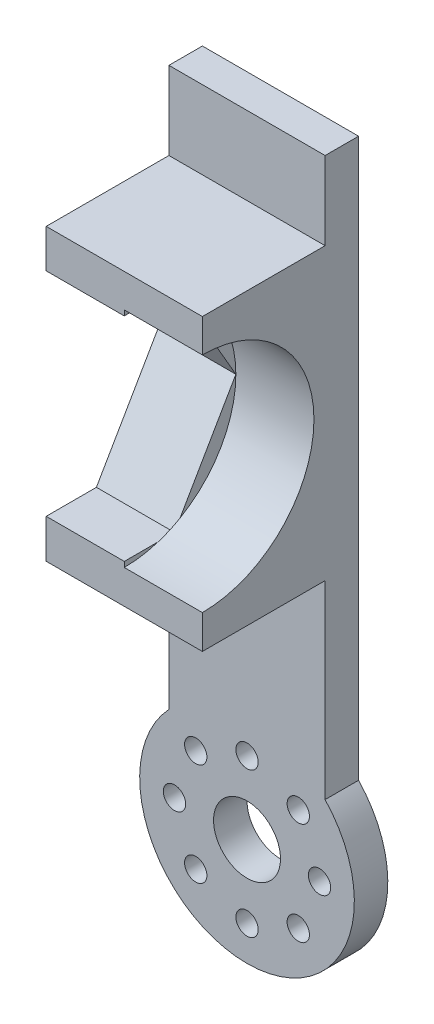
ISO-10303-21;
HEADER;
FILE_DESCRIPTION(('STEP AP214'),'2;1');
FILE_NAME('part.step','',(''),(''),'','','');
FILE_SCHEMA(('AUTOMOTIVE_DESIGN { 1 0 10303 214 1 1 1 1 }'));
ENDSEC;
DATA;
#1=APPLICATION_CONTEXT('core data for automotive mechanical design processes');
#2=APPLICATION_PROTOCOL_DEFINITION('international standard','automotive_design',2000,#1);
#3=PRODUCT_CONTEXT('',#1,'mechanical');
#4=PRODUCT('Part','Part','',(#3));
#5=PRODUCT_RELATED_PRODUCT_CATEGORY('part','',(#4));
#6=PRODUCT_DEFINITION_FORMATION('','',#4);
#7=PRODUCT_DEFINITION_CONTEXT('part definition',#1,'design');
#8=PRODUCT_DEFINITION('design','',#6,#7);
#9=PRODUCT_DEFINITION_SHAPE('','',#8);
#10=(LENGTH_UNIT() NAMED_UNIT(*) SI_UNIT(.MILLI.,.METRE.));
#11=(NAMED_UNIT(*) PLANE_ANGLE_UNIT() SI_UNIT($,.RADIAN.));
#12=(NAMED_UNIT(*) SI_UNIT($,.STERADIAN.) SOLID_ANGLE_UNIT());
#13=UNCERTAINTY_MEASURE_WITH_UNIT(LENGTH_MEASURE(1.E-05),#10,'distance_accuracy_value','');
#14=(GEOMETRIC_REPRESENTATION_CONTEXT(3) GLOBAL_UNCERTAINTY_ASSIGNED_CONTEXT((#13)) GLOBAL_UNIT_ASSIGNED_CONTEXT((#10,
#11,#12)) REPRESENTATION_CONTEXT('',''));
#15=CARTESIAN_POINT('',(0.,0.,0.));
#16=DIRECTION('',(0.,0.,1.));
#17=DIRECTION('',(1.,0.,0.));
#18=AXIS2_PLACEMENT_3D('',#15,#16,#17);
#19=CARTESIAN_POINT('',(0.,0.,14.));
#20=DIRECTION('',(0.,0.,1.));
#21=DIRECTION('',(1.,0.,0.));
#22=AXIS2_PLACEMENT_3D('',#19,#20,#21);
#23=PLANE('',#22);
#24=DIRECTION('',(-1.,0.,0.));
#25=VECTOR('',#24,1.);
#26=CARTESIAN_POINT('',(7.,46.6185983279213,14.));
#27=LINE('',#26,#25);
#28=CARTESIAN_POINT('',(7.,46.6185983279213,14.));
#29=VERTEX_POINT('',#28);
#30=CARTESIAN_POINT('',(0.,46.6185983279213,14.));
#31=VERTEX_POINT('',#30);
#32=EDGE_CURVE('E281',#29,#31,#27,.T.);
#33=ORIENTED_EDGE('',*,*,#32,.F.);
#34=DIRECTION('',(0.,1.,0.));
#35=VECTOR('',#34,1.);
#36=CARTESIAN_POINT('',(7.,49.6001430213842,14.));
#37=LINE('',#36,#35);
#38=CARTESIAN_POINT('',(7.,49.6001430213842,14.));
#39=VERTEX_POINT('',#38);
#40=EDGE_CURVE('E329',#29,#39,#37,.T.);
#41=ORIENTED_EDGE('',*,*,#40,.T.);
#42=DIRECTION('',(-1.,0.,0.));
#43=VECTOR('',#42,1.);
#44=CARTESIAN_POINT('',(-7.,49.6001430213842,14.));
#45=LINE('',#44,#43);
#46=CARTESIAN_POINT('',(-7.,49.6001430213842,14.));
#47=VERTEX_POINT('',#46);
#48=EDGE_CURVE('E333',#39,#47,#45,.T.);
#49=ORIENTED_EDGE('',*,*,#48,.T.);
#50=DIRECTION('',(0.,-1.,0.));
#51=VECTOR('',#50,1.);
#52=CARTESIAN_POINT('',(-7.,49.6001430213842,14.));
#53=LINE('',#52,#51);
#54=CARTESIAN_POINT('',(-7.,46.1448777695501,14.));
#55=VERTEX_POINT('',#54);
#56=EDGE_CURVE('E323',#47,#55,#53,.T.);
#57=ORIENTED_EDGE('',*,*,#56,.T.);
#58=DIRECTION('',(-1.,0.,0.));
#59=VECTOR('',#58,1.);
#60=CARTESIAN_POINT('',(0.,46.1448777695501,14.));
#61=LINE('',#60,#59);
#62=CARTESIAN_POINT('',(0.,46.1448777695501,14.));
#63=VERTEX_POINT('',#62);
#64=EDGE_CURVE('E312',#63,#55,#61,.T.);
#65=ORIENTED_EDGE('',*,*,#64,.F.);
#66=DIRECTION('',(0.,-1.,0.));
#67=VECTOR('',#66,1.);
#68=CARTESIAN_POINT('',(0.,0.,14.));
#69=LINE('',#68,#67);
#70=EDGE_CURVE('E285',#31,#63,#69,.T.);
#71=ORIENTED_EDGE('',*,*,#70,.F.);
#72=EDGE_LOOP('',(#33,#41,#49,#57,#65,#71));
#73=FACE_BOUND('',#72,.T.);
#74=ADVANCED_FACE('F60',(#73),#23,.T.);
#75=CARTESIAN_POINT('',(0.,0.,0.));
#76=DIRECTION('',(-1.,0.,0.));
#77=DIRECTION('',(0.,0.,1.));
#78=AXIS2_PLACEMENT_3D('',#75,#76,#77);
#79=PLANE('',#78);
#80=CARTESIAN_POINT('',(0.,36.6185983279213,14.));
#81=DIRECTION('',(-1.,0.,0.));
#82=DIRECTION('',(0.,0.,1.));
#83=AXIS2_PLACEMENT_3D('',#80,#81,#82);
#84=CIRCLE('',#83,10.);
#85=CARTESIAN_POINT('',(0.,46.1448777695501,10.9586187348509));
#86=VERTEX_POINT('',#85);
#87=CARTESIAN_POINT('',(0.,45.2788523657657,8.99999999999999));
#88=VERTEX_POINT('',#87);
#89=EDGE_CURVE('E12',#86,#88,#84,.T.);
#90=ORIENTED_EDGE('',*,*,#89,.F.);
#91=DIRECTION('',(0.,0.,-1.));
#92=VECTOR('',#91,1.);
#93=CARTESIAN_POINT('',(0.,46.1448777695501,14.));
#94=LINE('',#93,#92);
#95=CARTESIAN_POINT('',(0.,46.1448777695501,9.49999999999999));
#96=VERTEX_POINT('',#95);
#97=EDGE_CURVE('E289',#86,#96,#94,.T.);
#98=ORIENTED_EDGE('',*,*,#97,.T.);
#99=DIRECTION('',(0.,-0.866025403784439,-0.499999999999999));
#100=VECTOR('',#99,1.);
#101=CARTESIAN_POINT('',(0.,46.1448777695501,9.49999999999999));
#102=LINE('',#101,#100);
#103=EDGE_CURVE('E290',#96,#88,#102,.T.);
#104=ORIENTED_EDGE('',*,*,#103,.T.);
#105=EDGE_LOOP('',(#90,#98,#104));
#106=FACE_BOUND('',#105,.T.);
#107=ADVANCED_FACE('F546',(#106),#79,.T.);
#108=CARTESIAN_POINT('',(0.,0.,3.));
#109=DIRECTION('',(0.,0.,1.));
#110=DIRECTION('',(1.,0.,0.));
#111=AXIS2_PLACEMENT_3D('',#108,#109,#110);
#112=PLANE('',#111);
#113=DIRECTION('',(-1.,0.,0.));
#114=VECTOR('',#113,1.);
#115=CARTESIAN_POINT('',(-7.,49.6001430213842,3.));
#116=LINE('',#115,#114);
#117=CARTESIAN_POINT('',(7.,49.6001430213842,3.));
#118=VERTEX_POINT('',#117);
#119=CARTESIAN_POINT('',(-7.,49.6001430213842,3.));
#120=VERTEX_POINT('',#119);
#121=EDGE_CURVE('E83',#118,#120,#116,.T.);
#122=ORIENTED_EDGE('',*,*,#121,.F.);
#123=DIRECTION('',(0.,1.,0.));
#124=VECTOR('',#123,1.);
#125=CARTESIAN_POINT('',(7.,0.,3.));
#126=LINE('',#125,#124);
#127=CARTESIAN_POINT('',(7.,56.6001430213842,3.));
#128=VERTEX_POINT('',#127);
#129=EDGE_CURVE('E422',#118,#128,#126,.T.);
#130=ORIENTED_EDGE('',*,*,#129,.T.);
#131=DIRECTION('',(1.,0.,0.));
#132=VECTOR('',#131,1.);
#133=CARTESIAN_POINT('',(0.,56.6001430213842,3.));
#134=LINE('',#133,#132);
#135=CARTESIAN_POINT('',(-7.,56.6001430213842,3.));
#136=VERTEX_POINT('',#135);
#137=EDGE_CURVE('E421',#136,#128,#134,.T.);
#138=ORIENTED_EDGE('',*,*,#137,.F.);
#139=DIRECTION('',(0.,1.,0.));
#140=VECTOR('',#139,1.);
#141=CARTESIAN_POINT('',(-7.,0.,3.));
#142=LINE('',#141,#140);
#143=EDGE_CURVE('E425',#120,#136,#142,.T.);
#144=ORIENTED_EDGE('',*,*,#143,.F.);
#145=EDGE_LOOP('',(#122,#130,#138,#144));
#146=FACE_BOUND('',#145,.T.);
#147=ADVANCED_FACE('F484',(#146),#112,.T.);
#148=CARTESIAN_POINT('',(0.,0.,0.));
#149=DIRECTION('',(0.,0.,1.));
#150=DIRECTION('',(1.,0.,0.));
#151=AXIS2_PLACEMENT_3D('',#148,#149,#150);
#152=PLANE('',#151);
#153=CARTESIAN_POINT('',(6.5,0.,0.));
#154=DIRECTION('',(0.,0.,-1.));
#155=DIRECTION('',(0.,1.,0.));
#156=AXIS2_PLACEMENT_3D('',#153,#154,#155);
#157=CIRCLE('',#156,1.);
#158=CARTESIAN_POINT('',(6.5,0.999999999999977,0.));
#159=VERTEX_POINT('',#158);
#160=EDGE_CURVE('E358',#159,#159,#157,.T.);
#161=ORIENTED_EDGE('',*,*,#160,.F.);
#162=EDGE_LOOP('',(#161));
#163=FACE_BOUND('',#162,.T.);
#164=CARTESIAN_POINT('',(4.59619407771253,-4.59619407771258,0.));
#165=DIRECTION('',(0.,0.,-1.));
#166=DIRECTION('',(0.707106781186551,0.707106781186544,0.));
#167=AXIS2_PLACEMENT_3D('',#164,#165,#166);
#168=CIRCLE('',#167,1.);
#169=CARTESIAN_POINT('',(5.30330085889909,-3.88908729652604,0.));
#170=VERTEX_POINT('',#169);
#171=EDGE_CURVE('E362',#170,#170,#168,.T.);
#172=ORIENTED_EDGE('',*,*,#171,.F.);
#173=EDGE_LOOP('',(#172));
#174=FACE_BOUND('',#173,.T.);
#175=CARTESIAN_POINT('',(0.,-6.5,0.));
#176=DIRECTION('',(0.,0.,-1.));
#177=DIRECTION('',(1.,0.,0.));
#178=AXIS2_PLACEMENT_3D('',#175,#176,#177);
#179=CIRCLE('',#178,1.);
#180=CARTESIAN_POINT('',(1.,-6.5,0.));
#181=VERTEX_POINT('',#180);
#182=EDGE_CURVE('E365',#181,#181,#179,.T.);
#183=ORIENTED_EDGE('',*,*,#182,.F.);
#184=EDGE_LOOP('',(#183));
#185=FACE_BOUND('',#184,.T.);
#186=CARTESIAN_POINT('',(-4.5961940777126,-4.59619407771252,0.));
#187=DIRECTION('',(0.,0.,-1.));
#188=DIRECTION('',(0.707106781186541,-0.707106781186554,0.));
#189=AXIS2_PLACEMENT_3D('',#186,#187,#188);
#190=CIRCLE('',#189,1.);
#191=CARTESIAN_POINT('',(-3.88908729652606,-5.30330085889907,0.));
#192=VERTEX_POINT('',#191);
#193=EDGE_CURVE('E354',#192,#192,#190,.T.);
#194=ORIENTED_EDGE('',*,*,#193,.F.);
#195=EDGE_LOOP('',(#194));
#196=FACE_BOUND('',#195,.T.);
#197=CARTESIAN_POINT('',(-6.5,0.,0.));
#198=DIRECTION('',(0.,0.,-1.));
#199=DIRECTION('',(0.,-1.,0.));
#200=AXIS2_PLACEMENT_3D('',#197,#198,#199);
#201=CIRCLE('',#200,1.);
#202=CARTESIAN_POINT('',(-6.50000000000001,-0.999999999999932,0.));
#203=VERTEX_POINT('',#202);
#204=EDGE_CURVE('E351',#203,#203,#201,.T.);
#205=ORIENTED_EDGE('',*,*,#204,.F.);
#206=EDGE_LOOP('',(#205));
#207=FACE_BOUND('',#206,.T.);
#208=CARTESIAN_POINT('',(-4.5961940777125,4.59619407771261,0.));
#209=DIRECTION('',(0.,0.,-1.));
#210=DIRECTION('',(-0.707106781186556,-0.707106781186539,0.));
#211=AXIS2_PLACEMENT_3D('',#208,#209,#210);
#212=CIRCLE('',#211,1.);
#213=CARTESIAN_POINT('',(-5.30330085889906,3.88908729652608,0.));
#214=VERTEX_POINT('',#213);
#215=EDGE_CURVE('E355',#214,#214,#212,.T.);
#216=ORIENTED_EDGE('',*,*,#215,.F.);
#217=EDGE_LOOP('',(#216));
#218=FACE_BOUND('',#217,.T.);
#219=CARTESIAN_POINT('',(4.59619407771257,4.59619407771255,0.));
#220=DIRECTION('',(0.,0.,-1.));
#221=DIRECTION('',(-0.707106781186546,0.707106781186549,0.));
#222=AXIS2_PLACEMENT_3D('',#219,#220,#221);
#223=CIRCLE('',#222,1.);
#224=CARTESIAN_POINT('',(3.88908729652602,5.3033008588991,0.));
#225=VERTEX_POINT('',#224);
#226=EDGE_CURVE('E361',#225,#225,#223,.T.);
#227=ORIENTED_EDGE('',*,*,#226,.F.);
#228=EDGE_LOOP('',(#227));
#229=FACE_BOUND('',#228,.T.);
#230=CARTESIAN_POINT('',(0.,36.6001430213842,0.));
#231=DIRECTION('',(0.,0.,-1.));
#232=DIRECTION('',(-1.,0.,0.));
#233=AXIS2_PLACEMENT_3D('',#230,#231,#232);
#234=CIRCLE('',#233,2.);
#235=CARTESIAN_POINT('',(-2.,36.6001430213842,0.));
#236=VERTEX_POINT('',#235);
#237=EDGE_CURVE('E373',#236,#236,#234,.T.);
#238=ORIENTED_EDGE('',*,*,#237,.F.);
#239=EDGE_LOOP('',(#238));
#240=FACE_BOUND('',#239,.T.);
#241=CARTESIAN_POINT('',(0.,6.5,0.));
#242=DIRECTION('',(0.,0.,-1.));
#243=DIRECTION('',(-1.,0.,0.));
#244=AXIS2_PLACEMENT_3D('',#241,#242,#243);
#245=CIRCLE('',#244,1.);
#246=CARTESIAN_POINT('',(-1.,6.5,0.));
#247=VERTEX_POINT('',#246);
#248=EDGE_CURVE('E376',#247,#247,#245,.T.);
#249=ORIENTED_EDGE('',*,*,#248,.F.);
#250=EDGE_LOOP('',(#249));
#251=FACE_BOUND('',#250,.T.);
#252=CARTESIAN_POINT('',(0.,0.,0.));
#253=DIRECTION('',(0.,0.,1.));
#254=DIRECTION('',(1.,0.,0.));
#255=AXIS2_PLACEMENT_3D('',#252,#253,#254);
#256=CIRCLE('',#255,3.);
#257=CARTESIAN_POINT('',(3.,0.,0.));
#258=VERTEX_POINT('',#257);
#259=EDGE_CURVE('E384',#258,#258,#256,.T.);
#260=ORIENTED_EDGE('',*,*,#259,.T.);
#261=EDGE_LOOP('',(#260));
#262=FACE_BOUND('',#261,.T.);
#263=DIRECTION('',(1.,0.,0.));
#264=VECTOR('',#263,1.);
#265=CARTESIAN_POINT('',(0.,48.6001430213842,0.));
#266=LINE('',#265,#264);
#267=CARTESIAN_POINT('',(-2.,48.6001430213842,0.));
#268=VERTEX_POINT('',#267);
#269=CARTESIAN_POINT('',(2.,48.6001430213842,0.));
#270=VERTEX_POINT('',#269);
#271=EDGE_CURVE('E397',#268,#270,#266,.T.);
#272=ORIENTED_EDGE('',*,*,#271,.F.);
#273=DIRECTION('',(0.,-1.,0.));
#274=VECTOR('',#273,1.);
#275=CARTESIAN_POINT('',(-1.99999999999999,0.,0.));
#276=LINE('',#275,#274);
#277=CARTESIAN_POINT('',(-2.,44.6001430213842,0.));
#278=VERTEX_POINT('',#277);
#279=EDGE_CURVE('E404',#268,#278,#276,.T.);
#280=ORIENTED_EDGE('',*,*,#279,.T.);
#281=DIRECTION('',(1.,0.,0.));
#282=VECTOR('',#281,1.);
#283=CARTESIAN_POINT('',(0.,44.6001430213842,0.));
#284=LINE('',#283,#282);
#285=CARTESIAN_POINT('',(2.,44.6001430213842,0.));
#286=VERTEX_POINT('',#285);
#287=EDGE_CURVE('E237',#278,#286,#284,.T.);
#288=ORIENTED_EDGE('',*,*,#287,.T.);
#289=DIRECTION('',(0.,-1.,0.));
#290=VECTOR('',#289,1.);
#291=CARTESIAN_POINT('',(2.00000000000001,0.,0.));
#292=LINE('',#291,#290);
#293=EDGE_CURVE('E400',#270,#286,#292,.T.);
#294=ORIENTED_EDGE('',*,*,#293,.F.);
#295=EDGE_LOOP('',(#272,#280,#288,#294));
#296=FACE_BOUND('',#295,.T.);
#297=DIRECTION('',(0.,1.,0.));
#298=VECTOR('',#297,1.);
#299=CARTESIAN_POINT('',(7.,0.,0.));
#300=LINE('',#299,#298);
#301=CARTESIAN_POINT('',(7.,6.60014302138418,0.));
#302=VERTEX_POINT('',#301);
#303=CARTESIAN_POINT('',(7.,56.6001430213842,0.));
#304=VERTEX_POINT('',#303);
#305=EDGE_CURVE('E430',#302,#304,#300,.T.);
#306=ORIENTED_EDGE('',*,*,#305,.F.);
#307=CARTESIAN_POINT('',(0.,0.,0.));
#308=DIRECTION('',(0.,0.,1.));
#309=DIRECTION('',(1.,0.,0.));
#310=AXIS2_PLACEMENT_3D('',#307,#308,#309);
#311=CIRCLE('',#310,9.62090889171737);
#312=CARTESIAN_POINT('',(-7.,6.60014302138418,0.));
#313=VERTEX_POINT('',#312);
#314=EDGE_CURVE('E407',#313,#302,#311,.T.);
#315=ORIENTED_EDGE('',*,*,#314,.F.);
#316=DIRECTION('',(0.,1.,0.));
#317=VECTOR('',#316,1.);
#318=CARTESIAN_POINT('',(-7.,0.,0.));
#319=LINE('',#318,#317);
#320=CARTESIAN_POINT('',(-7.,56.6001430213842,0.));
#321=VERTEX_POINT('',#320);
#322=EDGE_CURVE('E437',#313,#321,#319,.T.);
#323=ORIENTED_EDGE('',*,*,#322,.T.);
#324=DIRECTION('',(1.,0.,0.));
#325=VECTOR('',#324,1.);
#326=CARTESIAN_POINT('',(0.,56.6001430213842,0.));
#327=LINE('',#326,#325);
#328=EDGE_CURVE('E433',#321,#304,#327,.T.);
#329=ORIENTED_EDGE('',*,*,#328,.T.);
#330=EDGE_LOOP('',(#306,#315,#323,#329));
#331=FACE_BOUND('',#330,.T.);
#332=DIRECTION('',(1.,0.,0.));
#333=VECTOR('',#332,1.);
#334=CARTESIAN_POINT('',(0.,28.6001430213842,0.));
#335=LINE('',#334,#333);
#336=CARTESIAN_POINT('',(-2.,28.6001430213842,0.));
#337=VERTEX_POINT('',#336);
#338=CARTESIAN_POINT('',(2.,28.6001430213842,0.));
#339=VERTEX_POINT('',#338);
#340=EDGE_CURVE('E389',#337,#339,#335,.T.);
#341=ORIENTED_EDGE('',*,*,#340,.F.);
#342=DIRECTION('',(0.,-1.,0.));
#343=VECTOR('',#342,1.);
#344=CARTESIAN_POINT('',(-1.99999999999999,0.,0.));
#345=LINE('',#344,#343);
#346=CARTESIAN_POINT('',(-2.,24.6001430213842,0.));
#347=VERTEX_POINT('',#346);
#348=EDGE_CURVE('E387',#337,#347,#345,.T.);
#349=ORIENTED_EDGE('',*,*,#348,.T.);
#350=DIRECTION('',(1.,0.,0.));
#351=VECTOR('',#350,1.);
#352=CARTESIAN_POINT('',(0.,24.6001430213842,0.));
#353=LINE('',#352,#351);
#354=CARTESIAN_POINT('',(2.,24.6001430213842,0.));
#355=VERTEX_POINT('',#354);
#356=EDGE_CURVE('E395',#347,#355,#353,.T.);
#357=ORIENTED_EDGE('',*,*,#356,.T.);
#358=DIRECTION('',(0.,-1.,0.));
#359=VECTOR('',#358,1.);
#360=CARTESIAN_POINT('',(2.,0.,0.));
#361=LINE('',#360,#359);
#362=EDGE_CURVE('E392',#339,#355,#361,.T.);
#363=ORIENTED_EDGE('',*,*,#362,.F.);
#364=EDGE_LOOP('',(#341,#349,#357,#363));
#365=FACE_BOUND('',#364,.T.);
#366=ADVANCED_FACE('F481',(#163,#174,#185,#196,#207,#218,#229,#240,#251,#262,#296,#331,#365),
#152,.F.);
#367=DIRECTION('',(1.,0.,0.));
#368=VECTOR('',#367,1.);
#369=CARTESIAN_POINT('',(-7.,23.6001430213842,3.));
#370=LINE('',#369,#368);
#371=CARTESIAN_POINT('',(-7.,23.6001430213842,3.));
#372=VERTEX_POINT('',#371);
#373=CARTESIAN_POINT('',(7.,23.6001430213842,3.));
#374=VERTEX_POINT('',#373);
#375=EDGE_CURVE('E314',#372,#374,#370,.T.);
#376=ORIENTED_EDGE('',*,*,#375,.F.);
#377=CARTESIAN_POINT('',(-7.,6.60014302138418,3.));
#378=VERTEX_POINT('',#377);
#379=EDGE_CURVE('E426',#378,#372,#142,.T.);
#380=ORIENTED_EDGE('',*,*,#379,.F.);
#381=CARTESIAN_POINT('',(0.,0.,3.));
#382=DIRECTION('',(0.,0.,1.));
#383=DIRECTION('',(1.,0.,0.));
#384=AXIS2_PLACEMENT_3D('',#381,#382,#383);
#385=CIRCLE('',#384,9.62090889171737);
#386=CARTESIAN_POINT('',(7.,6.60014302138418,3.));
#387=VERTEX_POINT('',#386);
#388=EDGE_CURVE('E434',#378,#387,#385,.T.);
#389=ORIENTED_EDGE('',*,*,#388,.T.);
#390=EDGE_CURVE('E419',#387,#374,#126,.T.);
#391=ORIENTED_EDGE('',*,*,#390,.T.);
#392=EDGE_LOOP('',(#376,#380,#389,#391));
#393=FACE_BOUND('',#392,.T.);
#394=CARTESIAN_POINT('',(6.5,0.,3.));
#395=DIRECTION('',(0.,0.,1.));
#396=DIRECTION('',(1.,0.,0.));
#397=AXIS2_PLACEMENT_3D('',#394,#395,#396);
#398=CIRCLE('',#397,1.);
#399=CARTESIAN_POINT('',(7.5,0.,3.));
#400=VERTEX_POINT('',#399);
#401=EDGE_CURVE('E377',#400,#400,#398,.T.);
#402=ORIENTED_EDGE('',*,*,#401,.F.);
#403=EDGE_LOOP('',(#402));
#404=FACE_BOUND('',#403,.T.);
#405=CARTESIAN_POINT('',(4.59619407771253,-4.59619407771258,3.));
#406=DIRECTION('',(0.,0.,1.));
#407=DIRECTION('',(1.,0.,0.));
#408=AXIS2_PLACEMENT_3D('',#405,#406,#407);
#409=CIRCLE('',#408,1.);
#410=CARTESIAN_POINT('',(5.59619407771253,-4.59619407771258,3.));
#411=VERTEX_POINT('',#410);
#412=EDGE_CURVE('E469',#411,#411,#409,.T.);
#413=ORIENTED_EDGE('',*,*,#412,.F.);
#414=EDGE_LOOP('',(#413));
#415=FACE_BOUND('',#414,.T.);
#416=CARTESIAN_POINT('',(0.,-6.5,3.));
#417=DIRECTION('',(0.,0.,1.));
#418=DIRECTION('',(1.,0.,0.));
#419=AXIS2_PLACEMENT_3D('',#416,#417,#418);
#420=CIRCLE('',#419,1.);
#421=CARTESIAN_POINT('',(1.,-6.5,3.));
#422=VERTEX_POINT('',#421);
#423=EDGE_CURVE('E466',#422,#422,#420,.T.);
#424=ORIENTED_EDGE('',*,*,#423,.F.);
#425=EDGE_LOOP('',(#424));
#426=FACE_BOUND('',#425,.T.);
#427=CARTESIAN_POINT('',(-4.5961940777126,-4.59619407771252,3.));
#428=DIRECTION('',(0.,0.,1.));
#429=DIRECTION('',(1.,0.,0.));
#430=AXIS2_PLACEMENT_3D('',#427,#428,#429);
#431=CIRCLE('',#430,1.);
#432=CARTESIAN_POINT('',(-3.5961940777126,-4.59619407771252,3.));
#433=VERTEX_POINT('',#432);
#434=EDGE_CURVE('E463',#433,#433,#431,.T.);
#435=ORIENTED_EDGE('',*,*,#434,.F.);
#436=EDGE_LOOP('',(#435));
#437=FACE_BOUND('',#436,.T.);
#438=CARTESIAN_POINT('',(-6.5,0.,3.));
#439=DIRECTION('',(0.,0.,1.));
#440=DIRECTION('',(1.,0.,0.));
#441=AXIS2_PLACEMENT_3D('',#438,#439,#440);
#442=CIRCLE('',#441,1.);
#443=CARTESIAN_POINT('',(-5.5,0.,3.));
#444=VERTEX_POINT('',#443);
#445=EDGE_CURVE('E460',#444,#444,#442,.T.);
#446=ORIENTED_EDGE('',*,*,#445,.F.);
#447=EDGE_LOOP('',(#446));
#448=FACE_BOUND('',#447,.T.);
#449=CARTESIAN_POINT('',(-4.5961940777125,4.59619407771261,3.));
#450=DIRECTION('',(0.,0.,1.));
#451=DIRECTION('',(1.,0.,0.));
#452=AXIS2_PLACEMENT_3D('',#449,#450,#451);
#453=CIRCLE('',#452,1.);
#454=CARTESIAN_POINT('',(-3.5961940777125,4.59619407771261,3.));
#455=VERTEX_POINT('',#454);
#456=EDGE_CURVE('E457',#455,#455,#453,.T.);
#457=ORIENTED_EDGE('',*,*,#456,.F.);
#458=EDGE_LOOP('',(#457));
#459=FACE_BOUND('',#458,.T.);
#460=CARTESIAN_POINT('',(4.59619407771257,4.59619407771255,3.));
#461=DIRECTION('',(0.,0.,1.));
#462=DIRECTION('',(1.,0.,0.));
#463=AXIS2_PLACEMENT_3D('',#460,#461,#462);
#464=CIRCLE('',#463,1.);
#465=CARTESIAN_POINT('',(5.59619407771257,4.59619407771255,3.));
#466=VERTEX_POINT('',#465);
#467=EDGE_CURVE('E372',#466,#466,#464,.T.);
#468=ORIENTED_EDGE('',*,*,#467,.F.);
#469=EDGE_LOOP('',(#468));
#470=FACE_BOUND('',#469,.T.);
#471=CARTESIAN_POINT('',(0.,6.5,3.));
#472=DIRECTION('',(0.,0.,1.));
#473=DIRECTION('',(1.,0.,0.));
#474=AXIS2_PLACEMENT_3D('',#471,#472,#473);
#475=CIRCLE('',#474,1.);
#476=CARTESIAN_POINT('',(1.,6.5,3.));
#477=VERTEX_POINT('',#476);
#478=EDGE_CURVE('E380',#477,#477,#475,.T.);
#479=ORIENTED_EDGE('',*,*,#478,.F.);
#480=EDGE_LOOP('',(#479));
#481=FACE_BOUND('',#480,.T.);
#482=CARTESIAN_POINT('',(0.,0.,3.));
#483=DIRECTION('',(0.,0.,1.));
#484=DIRECTION('',(1.,0.,0.));
#485=AXIS2_PLACEMENT_3D('',#482,#483,#484);
#486=CIRCLE('',#485,3.);
#487=CARTESIAN_POINT('',(3.,0.,3.));
#488=VERTEX_POINT('',#487);
#489=EDGE_CURVE('E381',#488,#488,#486,.T.);
#490=ORIENTED_EDGE('',*,*,#489,.F.);
#491=EDGE_LOOP('',(#490));
#492=FACE_BOUND('',#491,.T.);
#493=ADVANCED_FACE('F477',(#393,#404,#415,#426,#437,#448,#459,#470,#481,#492),#112,.T.);
#494=CARTESIAN_POINT('',(7.,0.,3.));
#495=DIRECTION('',(-1.,0.,0.));
#496=DIRECTION('',(0.,0.,1.));
#497=AXIS2_PLACEMENT_3D('',#494,#495,#496);
#498=PLANE('',#497);
#499=ORIENTED_EDGE('',*,*,#40,.F.);
#500=CARTESIAN_POINT('',(7.,36.6185983279213,14.));
#501=DIRECTION('',(-1.,0.,0.));
#502=DIRECTION('',(0.,0.,1.));
#503=AXIS2_PLACEMENT_3D('',#500,#501,#502);
#504=CIRCLE('',#503,10.);
#505=CARTESIAN_POINT('',(7.,26.6185983279213,14.));
#506=VERTEX_POINT('',#505);
#507=EDGE_CURVE('E272',#29,#506,#504,.T.);
#508=ORIENTED_EDGE('',*,*,#507,.T.);
#509=CARTESIAN_POINT('',(7.,23.6001430213842,14.));
#510=VERTEX_POINT('',#509);
#511=EDGE_CURVE('E330',#510,#506,#37,.T.);
#512=ORIENTED_EDGE('',*,*,#511,.F.);
#513=DIRECTION('',(0.,0.,-1.));
#514=VECTOR('',#513,1.);
#515=CARTESIAN_POINT('',(7.,23.6001430213842,14.));
#516=LINE('',#515,#514);
#517=EDGE_CURVE('E344',#510,#374,#516,.T.);
#518=ORIENTED_EDGE('',*,*,#517,.T.);
#519=ORIENTED_EDGE('',*,*,#390,.F.);
#520=DIRECTION('',(0.,0.,-1.));
#521=VECTOR('',#520,1.);
#522=CARTESIAN_POINT('',(7.,6.60014302138418,3.));
#523=LINE('',#522,#521);
#524=EDGE_CURVE('E445',#387,#302,#523,.T.);
#525=ORIENTED_EDGE('',*,*,#524,.T.);
#526=ORIENTED_EDGE('',*,*,#305,.T.);
#527=DIRECTION('',(0.,0.,-1.));
#528=VECTOR('',#527,1.);
#529=CARTESIAN_POINT('',(7.,56.6001430213842,3.));
#530=LINE('',#529,#528);
#531=EDGE_CURVE('E443',#128,#304,#530,.T.);
#532=ORIENTED_EDGE('',*,*,#531,.F.);
#533=ORIENTED_EDGE('',*,*,#129,.F.);
#534=DIRECTION('',(0.,0.,-1.));
#535=VECTOR('',#534,1.);
#536=CARTESIAN_POINT('',(7.,49.6001430213842,14.));
#537=LINE('',#536,#535);
#538=EDGE_CURVE('E341',#39,#118,#537,.T.);
#539=ORIENTED_EDGE('',*,*,#538,.F.);
#540=EDGE_LOOP('',(#499,#508,#512,#518,#519,#525,#526,#532,#533,#539));
#541=FACE_BOUND('',#540,.T.);
#542=ADVANCED_FACE('F480',(#541),#498,.F.);
#543=CARTESIAN_POINT('',(0.,56.6001430213842,3.));
#544=DIRECTION('',(0.,1.,0.));
#545=DIRECTION('',(0.,0.,1.));
#546=AXIS2_PLACEMENT_3D('',#543,#544,#545);
#547=PLANE('',#546);
#548=ORIENTED_EDGE('',*,*,#328,.F.);
#549=DIRECTION('',(0.,0.,-1.));
#550=VECTOR('',#549,1.);
#551=CARTESIAN_POINT('',(-7.,56.6001430213842,3.));
#552=LINE('',#551,#550);
#553=EDGE_CURVE('E441',#136,#321,#552,.T.);
#554=ORIENTED_EDGE('',*,*,#553,.F.);
#555=ORIENTED_EDGE('',*,*,#137,.T.);
#556=ORIENTED_EDGE('',*,*,#531,.T.);
#557=EDGE_LOOP('',(#548,#554,#555,#556));
#558=FACE_BOUND('',#557,.T.);
#559=ADVANCED_FACE('F817',(#558),#547,.T.);
#560=CARTESIAN_POINT('',(-7.,0.,3.));
#561=DIRECTION('',(-1.,0.,0.));
#562=DIRECTION('',(0.,0.,1.));
#563=AXIS2_PLACEMENT_3D('',#560,#561,#562);
#564=PLANE('',#563);
#565=DIRECTION('',(0.,0.,-1.));
#566=VECTOR('',#565,1.);
#567=CARTESIAN_POINT('',(-7.,46.1448777695501,14.));
#568=LINE('',#567,#566);
#569=CARTESIAN_POINT('',(-7.,46.1448777695501,9.49999999999999));
#570=VERTEX_POINT('',#569);
#571=EDGE_CURVE('E301',#55,#570,#568,.T.);
#572=ORIENTED_EDGE('',*,*,#571,.F.);
#573=ORIENTED_EDGE('',*,*,#56,.F.);
#574=DIRECTION('',(0.,0.,-1.));
#575=VECTOR('',#574,1.);
#576=CARTESIAN_POINT('',(-7.,49.6001430213842,14.));
#577=LINE('',#576,#575);
#578=EDGE_CURVE('E335',#47,#120,#577,.T.);
#579=ORIENTED_EDGE('',*,*,#578,.T.);
#580=ORIENTED_EDGE('',*,*,#143,.T.);
#581=ORIENTED_EDGE('',*,*,#553,.T.);
#582=ORIENTED_EDGE('',*,*,#322,.F.);
#583=DIRECTION('',(0.,0.,-1.));
#584=VECTOR('',#583,1.);
#585=CARTESIAN_POINT('',(-7.,6.60014302138418,3.));
#586=LINE('',#585,#584);
#587=EDGE_CURVE('E429',#378,#313,#586,.T.);
#588=ORIENTED_EDGE('',*,*,#587,.F.);
#589=ORIENTED_EDGE('',*,*,#379,.T.);
#590=DIRECTION('',(0.,0.,-1.));
#591=VECTOR('',#590,1.);
#592=CARTESIAN_POINT('',(-7.,23.6001430213842,14.));
#593=LINE('',#592,#591);
#594=CARTESIAN_POINT('',(-7.,23.6001430213842,14.));
#595=VERTEX_POINT('',#594);
#596=EDGE_CURVE('E347',#595,#372,#593,.T.);
#597=ORIENTED_EDGE('',*,*,#596,.F.);
#598=CARTESIAN_POINT('',(-7.,27.0923188862925,14.));
#599=VERTEX_POINT('',#598);
#600=EDGE_CURVE('E327',#599,#595,#53,.T.);
#601=ORIENTED_EDGE('',*,*,#600,.F.);
#602=DIRECTION('',(0.,0.,1.));
#603=VECTOR('',#602,1.);
#604=CARTESIAN_POINT('',(-7.,27.0923188862925,9.5));
#605=LINE('',#604,#603);
#606=CARTESIAN_POINT('',(-7.,27.0923188862925,9.5));
#607=VERTEX_POINT('',#606);
#608=EDGE_CURVE('E310',#607,#599,#605,.T.);
#609=ORIENTED_EDGE('',*,*,#608,.F.);
#610=DIRECTION('',(0.,-0.866025403784439,0.5));
#611=VECTOR('',#610,1.);
#612=CARTESIAN_POINT('',(-7.,36.6185983279213,4.));
#613=LINE('',#612,#611);
#614=CARTESIAN_POINT('',(-7.,36.6185983279213,4.));
#615=VERTEX_POINT('',#614);
#616=EDGE_CURVE('E307',#615,#607,#613,.T.);
#617=ORIENTED_EDGE('',*,*,#616,.F.);
#618=DIRECTION('',(0.,-0.866025403784439,-0.499999999999999));
#619=VECTOR('',#618,1.);
#620=CARTESIAN_POINT('',(-7.,46.1448777695501,9.49999999999999));
#621=LINE('',#620,#619);
#622=EDGE_CURVE('E304',#570,#615,#621,.T.);
#623=ORIENTED_EDGE('',*,*,#622,.F.);
#624=EDGE_LOOP('',(#572,#573,#579,#580,#581,#582,#588,#589,#597,#601,#609,#617,#623));
#625=FACE_BOUND('',#624,.T.);
#626=ADVANCED_FACE('F596',(#625),#564,.T.);
#627=CARTESIAN_POINT('',(0.,0.,3.));
#628=DIRECTION('',(0.,0.,-1.));
#629=DIRECTION('',(-1.,0.,0.));
#630=AXIS2_PLACEMENT_3D('',#627,#628,#629);
#631=CYLINDRICAL_SURFACE('',#630,9.62090889171737);
#632=ORIENTED_EDGE('',*,*,#314,.T.);
#633=ORIENTED_EDGE('',*,*,#524,.F.);
#634=ORIENTED_EDGE('',*,*,#388,.F.);
#635=ORIENTED_EDGE('',*,*,#587,.T.);
#636=EDGE_LOOP('',(#632,#633,#634,#635));
#637=FACE_BOUND('',#636,.T.);
#638=ADVANCED_FACE('F62',(#637),#631,.T.);
#639=CARTESIAN_POINT('',(0.,28.6001430213842,0.));
#640=DIRECTION('',(0.,-1.,0.));
#641=DIRECTION('',(0.,0.,-1.));
#642=AXIS2_PLACEMENT_3D('',#639,#640,#641);
#643=PLANE('',#642);
#644=DIRECTION('',(0.,0.,1.));
#645=VECTOR('',#644,1.);
#646=CARTESIAN_POINT('',(2.,28.6001430213842,0.));
#647=LINE('',#646,#645);
#648=CARTESIAN_POINT('',(2.,28.6001430213842,4.));
#649=VERTEX_POINT('',#648);
#650=EDGE_CURVE('E416',#339,#649,#647,.T.);
#651=ORIENTED_EDGE('',*,*,#650,.T.);
#652=DIRECTION('',(1.,0.,0.));
#653=VECTOR('',#652,1.);
#654=CARTESIAN_POINT('',(-2.,28.6001430213842,4.));
#655=LINE('',#654,#653);
#656=CARTESIAN_POINT('',(-2.,28.6001430213842,4.));
#657=VERTEX_POINT('',#656);
#658=EDGE_CURVE('E258',#657,#649,#655,.T.);
#659=ORIENTED_EDGE('',*,*,#658,.F.);
#660=DIRECTION('',(0.,0.,1.));
#661=VECTOR('',#660,1.);
#662=CARTESIAN_POINT('',(-2.,28.6001430213842,0.));
#663=LINE('',#662,#661);
#664=EDGE_CURVE('E406',#337,#657,#663,.T.);
#665=ORIENTED_EDGE('',*,*,#664,.F.);
#666=ORIENTED_EDGE('',*,*,#340,.T.);
#667=EDGE_LOOP('',(#651,#659,#665,#666));
#668=FACE_BOUND('',#667,.T.);
#669=ADVANCED_FACE('F523',(#668),#643,.T.);
#670=CARTESIAN_POINT('',(2.,0.,0.));
#671=DIRECTION('',(-1.,0.,0.));
#672=DIRECTION('',(0.,-1.,0.));
#673=AXIS2_PLACEMENT_3D('',#670,#671,#672);
#674=PLANE('',#673);
#675=DIRECTION('',(0.,0.,1.));
#676=VECTOR('',#675,1.);
#677=CARTESIAN_POINT('',(2.,24.6001430213842,0.));
#678=LINE('',#677,#676);
#679=CARTESIAN_POINT('',(2.,24.6001430213842,4.));
#680=VERTEX_POINT('',#679);
#681=EDGE_CURVE('E414',#355,#680,#678,.T.);
#682=ORIENTED_EDGE('',*,*,#681,.T.);
#683=DIRECTION('',(0.,-1.,0.));
#684=VECTOR('',#683,1.);
#685=CARTESIAN_POINT('',(2.,28.6001430213842,4.));
#686=LINE('',#685,#684);
#687=EDGE_CURVE('E255',#649,#680,#686,.T.);
#688=ORIENTED_EDGE('',*,*,#687,.F.);
#689=ORIENTED_EDGE('',*,*,#650,.F.);
#690=ORIENTED_EDGE('',*,*,#362,.T.);
#691=EDGE_LOOP('',(#682,#688,#689,#690));
#692=FACE_BOUND('',#691,.T.);
#693=ADVANCED_FACE('F534',(#692),#674,.T.);
#694=CARTESIAN_POINT('',(0.,24.6001430213842,0.));
#695=DIRECTION('',(0.,-1.,0.));
#696=DIRECTION('',(0.,0.,-1.));
#697=AXIS2_PLACEMENT_3D('',#694,#695,#696);
#698=PLANE('',#697);
#699=DIRECTION('',(0.,0.,1.));
#700=VECTOR('',#699,1.);
#701=CARTESIAN_POINT('',(-2.,24.6001430213842,0.));
#702=LINE('',#701,#700);
#703=CARTESIAN_POINT('',(-2.,24.6001430213842,4.));
#704=VERTEX_POINT('',#703);
#705=EDGE_CURVE('E412',#347,#704,#702,.T.);
#706=ORIENTED_EDGE('',*,*,#705,.T.);
#707=DIRECTION('',(-1.,0.,0.));
#708=VECTOR('',#707,1.);
#709=CARTESIAN_POINT('',(2.,24.6001430213842,4.));
#710=LINE('',#709,#708);
#711=EDGE_CURVE('E264',#680,#704,#710,.T.);
#712=ORIENTED_EDGE('',*,*,#711,.F.);
#713=ORIENTED_EDGE('',*,*,#681,.F.);
#714=ORIENTED_EDGE('',*,*,#356,.F.);
#715=EDGE_LOOP('',(#706,#712,#713,#714));
#716=FACE_BOUND('',#715,.T.);
#717=ADVANCED_FACE('F530',(#716),#698,.F.);
#718=CARTESIAN_POINT('',(-1.99999999999999,0.,0.));
#719=DIRECTION('',(-1.,0.,0.));
#720=DIRECTION('',(0.,-1.,0.));
#721=AXIS2_PLACEMENT_3D('',#718,#719,#720);
#722=PLANE('',#721);
#723=ORIENTED_EDGE('',*,*,#664,.T.);
#724=DIRECTION('',(0.,1.,0.));
#725=VECTOR('',#724,1.);
#726=CARTESIAN_POINT('',(-2.,24.6001430213842,4.));
#727=LINE('',#726,#725);
#728=EDGE_CURVE('E267',#704,#657,#727,.T.);
#729=ORIENTED_EDGE('',*,*,#728,.F.);
#730=ORIENTED_EDGE('',*,*,#705,.F.);
#731=ORIENTED_EDGE('',*,*,#348,.F.);
#732=EDGE_LOOP('',(#723,#729,#730,#731));
#733=FACE_BOUND('',#732,.T.);
#734=ADVANCED_FACE('F527',(#733),#722,.F.);
#735=CARTESIAN_POINT('',(0.,48.6001430213842,0.));
#736=DIRECTION('',(0.,-1.,0.));
#737=DIRECTION('',(0.,0.,-1.));
#738=AXIS2_PLACEMENT_3D('',#735,#736,#737);
#739=PLANE('',#738);
#740=DIRECTION('',(0.,0.,1.));
#741=VECTOR('',#740,1.);
#742=CARTESIAN_POINT('',(2.,48.6001430213842,0.));
#743=LINE('',#742,#741);
#744=CARTESIAN_POINT('',(2.,48.6001430213842,4.));
#745=VERTEX_POINT('',#744);
#746=EDGE_CURVE('E410',#270,#745,#743,.T.);
#747=ORIENTED_EDGE('',*,*,#746,.T.);
#748=DIRECTION('',(1.,0.,0.));
#749=VECTOR('',#748,1.);
#750=CARTESIAN_POINT('',(-2.,48.6001430213842,4.));
#751=LINE('',#750,#749);
#752=CARTESIAN_POINT('',(-2.,48.6001430213842,4.));
#753=VERTEX_POINT('',#752);
#754=EDGE_CURVE('E250',#753,#745,#751,.T.);
#755=ORIENTED_EDGE('',*,*,#754,.F.);
#756=DIRECTION('',(0.,0.,1.));
#757=VECTOR('',#756,1.);
#758=CARTESIAN_POINT('',(-2.,48.6001430213842,0.));
#759=LINE('',#758,#757);
#760=EDGE_CURVE('E240',#268,#753,#759,.T.);
#761=ORIENTED_EDGE('',*,*,#760,.F.);
#762=ORIENTED_EDGE('',*,*,#271,.T.);
#763=EDGE_LOOP('',(#747,#755,#761,#762));
#764=FACE_BOUND('',#763,.T.);
#765=ADVANCED_FACE('F856',(#764),#739,.T.);
#766=CARTESIAN_POINT('',(-1.99999999999999,0.,0.));
#767=DIRECTION('',(-1.,0.,0.));
#768=DIRECTION('',(0.,-1.,0.));
#769=AXIS2_PLACEMENT_3D('',#766,#767,#768);
#770=PLANE('',#769);
#771=ORIENTED_EDGE('',*,*,#760,.T.);
#772=DIRECTION('',(0.,1.,0.));
#773=VECTOR('',#772,1.);
#774=CARTESIAN_POINT('',(-2.,44.6001430213842,4.));
#775=LINE('',#774,#773);
#776=CARTESIAN_POINT('',(-2.,44.6001430213842,4.));
#777=VERTEX_POINT('',#776);
#778=EDGE_CURVE('E244',#777,#753,#775,.T.);
#779=ORIENTED_EDGE('',*,*,#778,.F.);
#780=DIRECTION('',(0.,0.,1.));
#781=VECTOR('',#780,1.);
#782=CARTESIAN_POINT('',(-2.,44.6001430213842,0.));
#783=LINE('',#782,#781);
#784=EDGE_CURVE('E230',#278,#777,#783,.T.);
#785=ORIENTED_EDGE('',*,*,#784,.F.);
#786=ORIENTED_EDGE('',*,*,#279,.F.);
#787=EDGE_LOOP('',(#771,#779,#785,#786));
#788=FACE_BOUND('',#787,.T.);
#789=ADVANCED_FACE('F245',(#788),#770,.F.);
#790=CARTESIAN_POINT('',(0.,44.6001430213842,0.));
#791=DIRECTION('',(0.,-1.,0.));
#792=DIRECTION('',(0.,0.,-1.));
#793=AXIS2_PLACEMENT_3D('',#790,#791,#792);
#794=PLANE('',#793);
#795=ORIENTED_EDGE('',*,*,#784,.T.);
#796=DIRECTION('',(-1.,0.,0.));
#797=VECTOR('',#796,1.);
#798=CARTESIAN_POINT('',(2.,44.6001430213842,4.));
#799=LINE('',#798,#797);
#800=CARTESIAN_POINT('',(2.,44.6001430213842,4.));
#801=VERTEX_POINT('',#800);
#802=EDGE_CURVE('E235',#801,#777,#799,.T.);
#803=ORIENTED_EDGE('',*,*,#802,.F.);
#804=DIRECTION('',(0.,0.,1.));
#805=VECTOR('',#804,1.);
#806=CARTESIAN_POINT('',(2.,44.6001430213842,0.));
#807=LINE('',#806,#805);
#808=EDGE_CURVE('E241',#286,#801,#807,.T.);
#809=ORIENTED_EDGE('',*,*,#808,.F.);
#810=ORIENTED_EDGE('',*,*,#287,.F.);
#811=EDGE_LOOP('',(#795,#803,#809,#810));
#812=FACE_BOUND('',#811,.T.);
#813=ADVANCED_FACE('F232',(#812),#794,.F.);
#814=CARTESIAN_POINT('',(2.00000000000001,0.,0.));
#815=DIRECTION('',(-1.,0.,0.));
#816=DIRECTION('',(0.,-1.,0.));
#817=AXIS2_PLACEMENT_3D('',#814,#815,#816);
#818=PLANE('',#817);
#819=ORIENTED_EDGE('',*,*,#808,.T.);
#820=DIRECTION('',(0.,-1.,0.));
#821=VECTOR('',#820,1.);
#822=CARTESIAN_POINT('',(2.,48.6001430213842,4.));
#823=LINE('',#822,#821);
#824=EDGE_CURVE('E254',#745,#801,#823,.T.);
#825=ORIENTED_EDGE('',*,*,#824,.F.);
#826=ORIENTED_EDGE('',*,*,#746,.F.);
#827=ORIENTED_EDGE('',*,*,#293,.T.);
#828=EDGE_LOOP('',(#819,#825,#826,#827));
#829=FACE_BOUND('',#828,.T.);
#830=ADVANCED_FACE('F505',(#829),#818,.T.);
#831=CARTESIAN_POINT('',(0.,0.,-7.));
#832=DIRECTION('',(0.,0.,1.));
#833=DIRECTION('',(1.,0.,0.));
#834=AXIS2_PLACEMENT_3D('',#831,#832,#833);
#835=CYLINDRICAL_SURFACE('',#834,3.);
#836=ORIENTED_EDGE('',*,*,#489,.T.);
#837=EDGE_LOOP('',(#836));
#838=FACE_BOUND('',#837,.T.);
#839=ORIENTED_EDGE('',*,*,#259,.F.);
#840=EDGE_LOOP('',(#839));
#841=FACE_BOUND('',#840,.T.);
#842=ADVANCED_FACE('F501',(#838,#841),#835,.F.);
#843=CARTESIAN_POINT('',(0.,6.5,10.));
#844=DIRECTION('',(0.,0.,-1.));
#845=DIRECTION('',(-1.,0.,0.));
#846=AXIS2_PLACEMENT_3D('',#843,#844,#845);
#847=CYLINDRICAL_SURFACE('',#846,1.);
#848=ORIENTED_EDGE('',*,*,#478,.T.);
#849=EDGE_LOOP('',(#848));
#850=FACE_BOUND('',#849,.T.);
#851=ORIENTED_EDGE('',*,*,#248,.T.);
#852=EDGE_LOOP('',(#851));
#853=FACE_BOUND('',#852,.T.);
#854=ADVANCED_FACE('F504',(#850,#853),#847,.F.);
#855=CARTESIAN_POINT('',(0.,36.6001430213842,10.));
#856=DIRECTION('',(0.,0.,-1.));
#857=DIRECTION('',(-1.,0.,0.));
#858=AXIS2_PLACEMENT_3D('',#855,#856,#857);
#859=CYLINDRICAL_SURFACE('',#858,2.);
#860=CARTESIAN_POINT('',(0.,36.6001430213842,3.));
#861=DIRECTION('',(0.,0.,1.));
#862=DIRECTION('',(1.,0.,0.));
#863=AXIS2_PLACEMENT_3D('',#860,#861,#862);
#864=CIRCLE('',#863,2.);
#865=CARTESIAN_POINT('',(2.,36.6001430213842,3.));
#866=VERTEX_POINT('',#865);
#867=EDGE_CURVE('E350',#866,#866,#864,.T.);
#868=ORIENTED_EDGE('',*,*,#867,.T.);
#869=EDGE_LOOP('',(#868));
#870=FACE_BOUND('',#869,.T.);
#871=ORIENTED_EDGE('',*,*,#237,.T.);
#872=EDGE_LOOP('',(#871));
#873=FACE_BOUND('',#872,.T.);
#874=ADVANCED_FACE('F768',(#870,#873),#859,.F.);
#875=CARTESIAN_POINT('',(4.59619407771257,4.59619407771255,10.));
#876=DIRECTION('',(0.,0.,-1.));
#877=DIRECTION('',(-1.,0.,0.));
#878=AXIS2_PLACEMENT_3D('',#875,#876,#877);
#879=CYLINDRICAL_SURFACE('',#878,1.);
#880=ORIENTED_EDGE('',*,*,#467,.T.);
#881=EDGE_LOOP('',(#880));
#882=FACE_BOUND('',#881,.T.);
#883=ORIENTED_EDGE('',*,*,#226,.T.);
#884=EDGE_LOOP('',(#883));
#885=FACE_BOUND('',#884,.T.);
#886=ADVANCED_FACE('F758',(#882,#885),#879,.F.);
#887=CARTESIAN_POINT('',(-4.5961940777125,4.59619407771261,10.));
#888=DIRECTION('',(0.,0.,-1.));
#889=DIRECTION('',(-1.,0.,0.));
#890=AXIS2_PLACEMENT_3D('',#887,#888,#889);
#891=CYLINDRICAL_SURFACE('',#890,1.);
#892=ORIENTED_EDGE('',*,*,#456,.T.);
#893=EDGE_LOOP('',(#892));
#894=FACE_BOUND('',#893,.T.);
#895=ORIENTED_EDGE('',*,*,#215,.T.);
#896=EDGE_LOOP('',(#895));
#897=FACE_BOUND('',#896,.T.);
#898=ADVANCED_FACE('F748',(#894,#897),#891,.F.);
#899=CARTESIAN_POINT('',(-6.5,0.,10.));
#900=DIRECTION('',(0.,0.,-1.));
#901=DIRECTION('',(-1.,0.,0.));
#902=AXIS2_PLACEMENT_3D('',#899,#900,#901);
#903=CYLINDRICAL_SURFACE('',#902,1.);
#904=ORIENTED_EDGE('',*,*,#445,.T.);
#905=EDGE_LOOP('',(#904));
#906=FACE_BOUND('',#905,.T.);
#907=ORIENTED_EDGE('',*,*,#204,.T.);
#908=EDGE_LOOP('',(#907));
#909=FACE_BOUND('',#908,.T.);
#910=ADVANCED_FACE('F738',(#906,#909),#903,.F.);
#911=CARTESIAN_POINT('',(-4.5961940777126,-4.59619407771252,10.));
#912=DIRECTION('',(0.,0.,-1.));
#913=DIRECTION('',(-1.,0.,0.));
#914=AXIS2_PLACEMENT_3D('',#911,#912,#913);
#915=CYLINDRICAL_SURFACE('',#914,1.);
#916=ORIENTED_EDGE('',*,*,#434,.T.);
#917=EDGE_LOOP('',(#916));
#918=FACE_BOUND('',#917,.T.);
#919=ORIENTED_EDGE('',*,*,#193,.T.);
#920=EDGE_LOOP('',(#919));
#921=FACE_BOUND('',#920,.T.);
#922=ADVANCED_FACE('F728',(#918,#921),#915,.F.);
#923=CARTESIAN_POINT('',(0.,-6.5,10.));
#924=DIRECTION('',(0.,0.,-1.));
#925=DIRECTION('',(-1.,0.,0.));
#926=AXIS2_PLACEMENT_3D('',#923,#924,#925);
#927=CYLINDRICAL_SURFACE('',#926,1.);
#928=ORIENTED_EDGE('',*,*,#423,.T.);
#929=EDGE_LOOP('',(#928));
#930=FACE_BOUND('',#929,.T.);
#931=ORIENTED_EDGE('',*,*,#182,.T.);
#932=EDGE_LOOP('',(#931));
#933=FACE_BOUND('',#932,.T.);
#934=ADVANCED_FACE('F718',(#930,#933),#927,.F.);
#935=CARTESIAN_POINT('',(4.59619407771253,-4.59619407771258,10.));
#936=DIRECTION('',(0.,0.,-1.));
#937=DIRECTION('',(-1.,0.,0.));
#938=AXIS2_PLACEMENT_3D('',#935,#936,#937);
#939=CYLINDRICAL_SURFACE('',#938,1.);
#940=ORIENTED_EDGE('',*,*,#412,.T.);
#941=EDGE_LOOP('',(#940));
#942=FACE_BOUND('',#941,.T.);
#943=ORIENTED_EDGE('',*,*,#171,.T.);
#944=EDGE_LOOP('',(#943));
#945=FACE_BOUND('',#944,.T.);
#946=ADVANCED_FACE('F569',(#942,#945),#939,.F.);
#947=CARTESIAN_POINT('',(6.5,0.,10.));
#948=DIRECTION('',(0.,0.,-1.));
#949=DIRECTION('',(-1.,0.,0.));
#950=AXIS2_PLACEMENT_3D('',#947,#948,#949);
#951=CYLINDRICAL_SURFACE('',#950,1.);
#952=ORIENTED_EDGE('',*,*,#401,.T.);
#953=EDGE_LOOP('',(#952));
#954=FACE_BOUND('',#953,.T.);
#955=ORIENTED_EDGE('',*,*,#160,.T.);
#956=EDGE_LOOP('',(#955));
#957=FACE_BOUND('',#956,.T.);
#958=ADVANCED_FACE('F474',(#954,#957),#951,.F.);
#959=DIRECTION('',(-1.,0.,0.));
#960=VECTOR('',#959,1.);
#961=CARTESIAN_POINT('',(7.,26.6185983279213,14.));
#962=LINE('',#961,#960);
#963=CARTESIAN_POINT('',(0.,26.6185983279213,14.));
#964=VERTEX_POINT('',#963);
#965=EDGE_CURVE('E275',#964,#506,#962,.F.);
#966=ORIENTED_EDGE('',*,*,#965,.F.);
#967=CARTESIAN_POINT('',(0.,27.0923188862925,14.));
#968=VERTEX_POINT('',#967);
#969=EDGE_CURVE('E283',#968,#964,#69,.T.);
#970=ORIENTED_EDGE('',*,*,#969,.F.);
#971=DIRECTION('',(-1.,0.,0.));
#972=VECTOR('',#971,1.);
#973=CARTESIAN_POINT('',(0.,27.0923188862925,14.));
#974=LINE('',#973,#972);
#975=EDGE_CURVE('E315',#968,#599,#974,.T.);
#976=ORIENTED_EDGE('',*,*,#975,.T.);
#977=ORIENTED_EDGE('',*,*,#600,.T.);
#978=DIRECTION('',(1.,0.,0.));
#979=VECTOR('',#978,1.);
#980=CARTESIAN_POINT('',(-7.,23.6001430213842,14.));
#981=LINE('',#980,#979);
#982=EDGE_CURVE('E326',#595,#510,#981,.T.);
#983=ORIENTED_EDGE('',*,*,#982,.T.);
#984=ORIENTED_EDGE('',*,*,#511,.T.);
#985=EDGE_LOOP('',(#966,#970,#976,#977,#983,#984));
#986=FACE_BOUND('',#985,.T.);
#987=ADVANCED_FACE('F549',(#986),#23,.T.);
#988=CARTESIAN_POINT('',(-7.,49.6001430213842,14.));
#989=DIRECTION('',(0.,-1.,0.));
#990=DIRECTION('',(0.,0.,-1.));
#991=AXIS2_PLACEMENT_3D('',#988,#989,#990);
#992=PLANE('',#991);
#993=ORIENTED_EDGE('',*,*,#121,.T.);
#994=ORIENTED_EDGE('',*,*,#578,.F.);
#995=ORIENTED_EDGE('',*,*,#48,.F.);
#996=ORIENTED_EDGE('',*,*,#538,.T.);
#997=EDGE_LOOP('',(#993,#994,#995,#996));
#998=FACE_BOUND('',#997,.T.);
#999=ADVANCED_FACE('F560',(#998),#992,.F.);
#1000=CARTESIAN_POINT('',(-7.,23.6001430213842,14.));
#1001=DIRECTION('',(0.,1.,0.));
#1002=DIRECTION('',(0.,0.,1.));
#1003=AXIS2_PLACEMENT_3D('',#1000,#1001,#1002);
#1004=PLANE('',#1003);
#1005=ORIENTED_EDGE('',*,*,#375,.T.);
#1006=ORIENTED_EDGE('',*,*,#517,.F.);
#1007=ORIENTED_EDGE('',*,*,#982,.F.);
#1008=ORIENTED_EDGE('',*,*,#596,.T.);
#1009=EDGE_LOOP('',(#1005,#1006,#1007,#1008));
#1010=FACE_BOUND('',#1009,.T.);
#1011=ADVANCED_FACE('F566',(#1010),#1004,.F.);
#1012=CARTESIAN_POINT('',(0.,0.,3.));
#1013=DIRECTION('',(0.,0.,1.));
#1014=DIRECTION('',(1.,0.,0.));
#1015=AXIS2_PLACEMENT_3D('',#1012,#1013,#1014);
#1016=PLANE('',#1015);
#1017=ORIENTED_EDGE('',*,*,#867,.F.);
#1018=EDGE_LOOP('',(#1017));
#1019=FACE_BOUND('',#1018,.T.);
#1020=ADVANCED_FACE('F665',(#1019),#1016,.F.);
#1021=CARTESIAN_POINT('',(0.,46.1448777695501,14.));
#1022=DIRECTION('',(0.,1.,0.));
#1023=DIRECTION('',(0.,0.,1.));
#1024=AXIS2_PLACEMENT_3D('',#1021,#1022,#1023);
#1025=PLANE('',#1024);
#1026=ORIENTED_EDGE('',*,*,#571,.T.);
#1027=DIRECTION('',(-1.,0.,0.));
#1028=VECTOR('',#1027,1.);
#1029=CARTESIAN_POINT('',(0.,46.1448777695501,9.49999999999999));
#1030=LINE('',#1029,#1028);
#1031=EDGE_CURVE('E300',#96,#570,#1030,.T.);
#1032=ORIENTED_EDGE('',*,*,#1031,.F.);
#1033=ORIENTED_EDGE('',*,*,#97,.F.);
#1034=EDGE_CURVE('E286',#63,#86,#94,.T.);
#1035=ORIENTED_EDGE('',*,*,#1034,.F.);
#1036=ORIENTED_EDGE('',*,*,#64,.T.);
#1037=EDGE_LOOP('',(#1026,#1032,#1033,#1035,#1036));
#1038=FACE_BOUND('',#1037,.T.);
#1039=ADVANCED_FACE('F591',(#1038),#1025,.F.);
#1040=CARTESIAN_POINT('',(0.,27.0923188862925,9.5));
#1041=DIRECTION('',(0.,-1.,0.));
#1042=DIRECTION('',(0.,0.,-1.));
#1043=AXIS2_PLACEMENT_3D('',#1040,#1041,#1042);
#1044=PLANE('',#1043);
#1045=ORIENTED_EDGE('',*,*,#608,.T.);
#1046=ORIENTED_EDGE('',*,*,#975,.F.);
#1047=DIRECTION('',(0.,0.,1.));
#1048=VECTOR('',#1047,1.);
#1049=CARTESIAN_POINT('',(0.,27.0923188862925,9.5));
#1050=LINE('',#1049,#1048);
#1051=CARTESIAN_POINT('',(0.,27.0923188862925,10.9586187348509));
#1052=VERTEX_POINT('',#1051);
#1053=EDGE_CURVE('E296',#1052,#968,#1050,.T.);
#1054=ORIENTED_EDGE('',*,*,#1053,.F.);
#1055=CARTESIAN_POINT('',(0.,27.0923188862925,9.5));
#1056=VERTEX_POINT('',#1055);
#1057=EDGE_CURVE('E297',#1056,#1052,#1050,.T.);
#1058=ORIENTED_EDGE('',*,*,#1057,.F.);
#1059=DIRECTION('',(-1.,0.,0.));
#1060=VECTOR('',#1059,1.);
#1061=CARTESIAN_POINT('',(0.,27.0923188862925,9.5));
#1062=LINE('',#1061,#1060);
#1063=EDGE_CURVE('E318',#1056,#607,#1062,.T.);
#1064=ORIENTED_EDGE('',*,*,#1063,.T.);
#1065=EDGE_LOOP('',(#1045,#1046,#1054,#1058,#1064));
#1066=FACE_BOUND('',#1065,.T.);
#1067=ADVANCED_FACE('F617',(#1066),#1044,.F.);
#1068=CARTESIAN_POINT('',(0.,36.6185983279213,4.));
#1069=DIRECTION('',(0.,-0.5,-0.866025403784439));
#1070=DIRECTION('',(0.,0.866025403784439,-0.5));
#1071=AXIS2_PLACEMENT_3D('',#1068,#1069,#1070);
#1072=PLANE('',#1071);
#1073=ORIENTED_EDGE('',*,*,#616,.T.);
#1074=ORIENTED_EDGE('',*,*,#1063,.F.);
#1075=DIRECTION('',(0.,-0.866025403784439,0.5));
#1076=VECTOR('',#1075,1.);
#1077=CARTESIAN_POINT('',(0.,36.6185983279213,4.));
#1078=LINE('',#1077,#1076);
#1079=CARTESIAN_POINT('',(0.,27.9583442900769,9.));
#1080=VERTEX_POINT('',#1079);
#1081=EDGE_CURVE('E293',#1080,#1056,#1078,.T.);
#1082=ORIENTED_EDGE('',*,*,#1081,.F.);
#1083=CARTESIAN_POINT('',(0.,36.6185983279213,4.));
#1084=VERTEX_POINT('',#1083);
#1085=EDGE_CURVE('E294',#1084,#1080,#1078,.T.);
#1086=ORIENTED_EDGE('',*,*,#1085,.F.);
#1087=DIRECTION('',(-1.,0.,0.));
#1088=VECTOR('',#1087,1.);
#1089=CARTESIAN_POINT('',(0.,36.6185983279213,4.));
#1090=LINE('',#1089,#1088);
#1091=EDGE_CURVE('E320',#1084,#615,#1090,.T.);
#1092=ORIENTED_EDGE('',*,*,#1091,.T.);
#1093=EDGE_LOOP('',(#1073,#1074,#1082,#1086,#1092));
#1094=FACE_BOUND('',#1093,.T.);
#1095=ADVANCED_FACE('F608',(#1094),#1072,.F.);
#1096=CARTESIAN_POINT('',(0.,46.1448777695501,9.49999999999999));
#1097=DIRECTION('',(0.,0.499999999999999,-0.866025403784439));
#1098=DIRECTION('',(0.,0.866025403784439,0.499999999999999));
#1099=AXIS2_PLACEMENT_3D('',#1096,#1097,#1098);
#1100=PLANE('',#1099);
#1101=ORIENTED_EDGE('',*,*,#622,.T.);
#1102=ORIENTED_EDGE('',*,*,#1091,.F.);
#1103=EDGE_CURVE('E288',#88,#1084,#102,.T.);
#1104=ORIENTED_EDGE('',*,*,#1103,.F.);
#1105=ORIENTED_EDGE('',*,*,#103,.F.);
#1106=ORIENTED_EDGE('',*,*,#1031,.T.);
#1107=EDGE_LOOP('',(#1101,#1102,#1104,#1105,#1106));
#1108=FACE_BOUND('',#1107,.T.);
#1109=ADVANCED_FACE('F602',(#1108),#1100,.F.);
#1110=EDGE_CURVE('E64',#1080,#1052,#84,.T.);
#1111=ORIENTED_EDGE('',*,*,#1110,.F.);
#1112=ORIENTED_EDGE('',*,*,#1081,.T.);
#1113=ORIENTED_EDGE('',*,*,#1057,.T.);
#1114=EDGE_LOOP('',(#1111,#1112,#1113));
#1115=FACE_BOUND('',#1114,.T.);
#1116=ADVANCED_FACE('F555',(#1115),#79,.T.);
#1117=CARTESIAN_POINT('',(0.,36.6185983279213,14.));
#1118=DIRECTION('',(-1.,0.,0.));
#1119=DIRECTION('',(0.,0.,1.));
#1120=AXIS2_PLACEMENT_3D('',#1117,#1118,#1119);
#1121=PLANE('',#1120);
#1122=ORIENTED_EDGE('',*,*,#70,.T.);
#1123=ORIENTED_EDGE('',*,*,#1034,.T.);
#1124=CARTESIAN_POINT('',(0.,36.6185983279213,14.));
#1125=DIRECTION('',(-1.,0.,0.));
#1126=DIRECTION('',(0.,0.,1.));
#1127=AXIS2_PLACEMENT_3D('',#1124,#1125,#1126);
#1128=CIRCLE('',#1127,10.);
#1129=EDGE_CURVE('E276',#31,#86,#1128,.T.);
#1130=ORIENTED_EDGE('',*,*,#1129,.F.);
#1131=EDGE_LOOP('',(#1122,#1123,#1130));
#1132=FACE_BOUND('',#1131,.T.);
#1133=ADVANCED_FACE('F587',(#1132),#1121,.F.);
#1134=EDGE_CURVE('E75',#1084,#1080,#1128,.T.);
#1135=ORIENTED_EDGE('',*,*,#1134,.F.);
#1136=ORIENTED_EDGE('',*,*,#1085,.T.);
#1137=EDGE_LOOP('',(#1135,#1136));
#1138=FACE_BOUND('',#1137,.T.);
#1139=ADVANCED_FACE('F612',(#1138),#1121,.F.);
#1140=EDGE_CURVE('E279',#88,#1084,#1128,.T.);
#1141=ORIENTED_EDGE('',*,*,#1140,.F.);
#1142=ORIENTED_EDGE('',*,*,#1103,.T.);
#1143=EDGE_LOOP('',(#1141,#1142));
#1144=FACE_BOUND('',#1143,.T.);
#1145=ADVANCED_FACE('F620',(#1144),#1121,.F.);
#1146=CARTESIAN_POINT('',(7.,36.6185983279213,14.));
#1147=DIRECTION('',(-1.,0.,0.));
#1148=DIRECTION('',(0.,0.,1.));
#1149=AXIS2_PLACEMENT_3D('',#1146,#1147,#1148);
#1150=CYLINDRICAL_SURFACE('',#1149,10.);
#1151=ORIENTED_EDGE('',*,*,#32,.T.);
#1152=ORIENTED_EDGE('',*,*,#1129,.T.);
#1153=ORIENTED_EDGE('',*,*,#89,.T.);
#1154=ORIENTED_EDGE('',*,*,#1140,.T.);
#1155=ORIENTED_EDGE('',*,*,#1134,.T.);
#1156=ORIENTED_EDGE('',*,*,#1110,.T.);
#1157=EDGE_CURVE('E263',#1052,#964,#1128,.T.);
#1158=ORIENTED_EDGE('',*,*,#1157,.T.);
#1159=ORIENTED_EDGE('',*,*,#965,.T.);
#1160=ORIENTED_EDGE('',*,*,#507,.F.);
#1161=EDGE_LOOP('',(#1151,#1152,#1153,#1154,#1155,#1156,#1158,#1159,#1160));
#1162=FACE_BOUND('',#1161,.T.);
#1163=ADVANCED_FACE('F576',(#1162),#1150,.F.);
#1164=ORIENTED_EDGE('',*,*,#969,.T.);
#1165=ORIENTED_EDGE('',*,*,#1157,.F.);
#1166=ORIENTED_EDGE('',*,*,#1053,.T.);
#1167=EDGE_LOOP('',(#1164,#1165,#1166));
#1168=FACE_BOUND('',#1167,.T.);
#1169=ADVANCED_FACE('F542',(#1168),#1121,.F.);
#1170=CARTESIAN_POINT('',(0.,0.,4.));
#1171=DIRECTION('',(0.,0.,-1.));
#1172=DIRECTION('',(-1.,0.,0.));
#1173=AXIS2_PLACEMENT_3D('',#1170,#1171,#1172);
#1174=PLANE('',#1173);
#1175=ORIENTED_EDGE('',*,*,#802,.T.);
#1176=ORIENTED_EDGE('',*,*,#778,.T.);
#1177=ORIENTED_EDGE('',*,*,#754,.T.);
#1178=ORIENTED_EDGE('',*,*,#824,.T.);
#1179=EDGE_LOOP('',(#1175,#1176,#1177,#1178));
#1180=FACE_BOUND('',#1179,.T.);
#1181=ADVANCED_FACE('F252',(#1180),#1174,.T.);
#1182=CARTESIAN_POINT('',(0.,0.,4.));
#1183=DIRECTION('',(0.,0.,-1.));
#1184=DIRECTION('',(-1.,0.,0.));
#1185=AXIS2_PLACEMENT_3D('',#1182,#1183,#1184);
#1186=PLANE('',#1185);
#1187=ORIENTED_EDGE('',*,*,#711,.T.);
#1188=ORIENTED_EDGE('',*,*,#728,.T.);
#1189=ORIENTED_EDGE('',*,*,#658,.T.);
#1190=ORIENTED_EDGE('',*,*,#687,.T.);
#1191=EDGE_LOOP('',(#1187,#1188,#1189,#1190));
#1192=FACE_BOUND('',#1191,.T.);
#1193=ADVANCED_FACE('F536',(#1192),#1186,.T.);
#1194=CLOSED_SHELL('',(#74,#107,#147,#366,#493,#542,#559,#626,#638,#669,#693,#717,#734,#765,
#789,#813,#830,#842,#854,#874,#886,#898,#910,#922,#934,#946,#958,#987,#999,#1011,#1020,#1039,
#1067,#1095,#1109,#1116,#1133,#1139,#1145,#1163,#1169,#1181,#1193));
#1195=MANIFOLD_SOLID_BREP('B2',#1194);
#1196=ADVANCED_BREP_SHAPE_REPRESENTATION('',(#18,#1195),#14);
#1197=SHAPE_DEFINITION_REPRESENTATION(#9,#1196);
ENDSEC;
END-ISO-10303-21;
